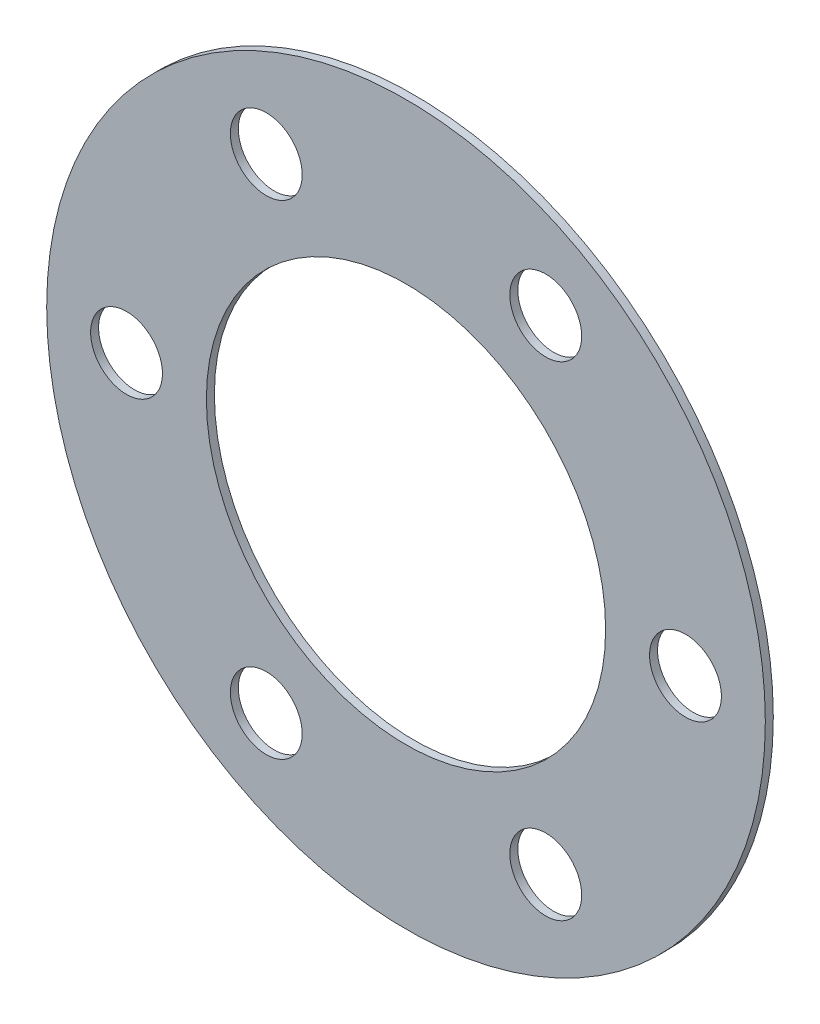
ISO-10303-21;
HEADER;
FILE_DESCRIPTION(('STEP AP214'),'2;1');
FILE_NAME('part.step','',(''),(''),'','','');
FILE_SCHEMA(('AUTOMOTIVE_DESIGN { 1 0 10303 214 1 1 1 1 }'));
ENDSEC;
DATA;
#1=APPLICATION_CONTEXT('core data for automotive mechanical design processes');
#2=APPLICATION_PROTOCOL_DEFINITION('international standard','automotive_design',2000,#1);
#3=PRODUCT_CONTEXT('',#1,'mechanical');
#4=PRODUCT('Part','Part','',(#3));
#5=PRODUCT_RELATED_PRODUCT_CATEGORY('part','',(#4));
#6=PRODUCT_DEFINITION_FORMATION('','',#4);
#7=PRODUCT_DEFINITION_CONTEXT('part definition',#1,'design');
#8=PRODUCT_DEFINITION('design','',#6,#7);
#9=PRODUCT_DEFINITION_SHAPE('','',#8);
#10=(LENGTH_UNIT() NAMED_UNIT(*) SI_UNIT(.MILLI.,.METRE.));
#11=(NAMED_UNIT(*) PLANE_ANGLE_UNIT() SI_UNIT($,.RADIAN.));
#12=(NAMED_UNIT(*) SI_UNIT($,.STERADIAN.) SOLID_ANGLE_UNIT());
#13=UNCERTAINTY_MEASURE_WITH_UNIT(LENGTH_MEASURE(1.E-05),#10,'distance_accuracy_value','');
#14=(GEOMETRIC_REPRESENTATION_CONTEXT(3) GLOBAL_UNCERTAINTY_ASSIGNED_CONTEXT((#13)) GLOBAL_UNIT_ASSIGNED_CONTEXT((#10,
#11,#12)) REPRESENTATION_CONTEXT('',''));
#15=CARTESIAN_POINT('',(0.,0.,0.));
#16=DIRECTION('',(0.,0.,1.));
#17=DIRECTION('',(1.,0.,0.));
#18=AXIS2_PLACEMENT_3D('',#15,#16,#17);
#19=CARTESIAN_POINT('',(0.,0.,1.));
#20=DIRECTION('',(0.,0.,1.));
#21=DIRECTION('',(1.,0.,0.));
#22=AXIS2_PLACEMENT_3D('',#19,#20,#21);
#23=PLANE('',#22);
#24=CARTESIAN_POINT('',(-35.,0.,1.));
#25=DIRECTION('',(0.,0.,1.));
#26=DIRECTION('',(1.,0.,0.));
#27=AXIS2_PLACEMENT_3D('',#24,#25,#26);
#28=CIRCLE('',#27,4.5);
#29=CARTESIAN_POINT('',(-30.5,0.,1.));
#30=VERTEX_POINT('',#29);
#31=EDGE_CURVE('E74',#30,#30,#28,.T.);
#32=ORIENTED_EDGE('',*,*,#31,.F.);
#33=EDGE_LOOP('',(#32));
#34=FACE_BOUND('',#33,.T.);
#35=CARTESIAN_POINT('',(17.4999999999997,-30.3108891324555,1.));
#36=DIRECTION('',(0.,0.,1.));
#37=DIRECTION('',(1.,0.,0.));
#38=AXIS2_PLACEMENT_3D('',#35,#36,#37);
#39=CIRCLE('',#38,4.5);
#40=CARTESIAN_POINT('',(21.9999999999997,-30.3108891324555,1.));
#41=VERTEX_POINT('',#40);
#42=EDGE_CURVE('E62',#41,#41,#39,.T.);
#43=ORIENTED_EDGE('',*,*,#42,.F.);
#44=EDGE_LOOP('',(#43));
#45=FACE_BOUND('',#44,.T.);
#46=CARTESIAN_POINT('',(17.5000000000001,30.3108891324553,1.));
#47=DIRECTION('',(0.,0.,1.));
#48=DIRECTION('',(1.,0.,0.));
#49=AXIS2_PLACEMENT_3D('',#46,#47,#48);
#50=CIRCLE('',#49,4.5);
#51=CARTESIAN_POINT('',(22.0000000000001,30.3108891324553,1.));
#52=VERTEX_POINT('',#51);
#53=EDGE_CURVE('E50',#52,#52,#50,.T.);
#54=ORIENTED_EDGE('',*,*,#53,.F.);
#55=EDGE_LOOP('',(#54));
#56=FACE_BOUND('',#55,.T.);
#57=CARTESIAN_POINT('',(0.,0.,1.));
#58=DIRECTION('',(0.,0.,1.));
#59=DIRECTION('',(1.,0.,0.));
#60=AXIS2_PLACEMENT_3D('',#57,#58,#59);
#61=CIRCLE('',#60,45.);
#62=CARTESIAN_POINT('',(45.,0.,1.));
#63=VERTEX_POINT('',#62);
#64=EDGE_CURVE('E10',#63,#63,#61,.T.);
#65=ORIENTED_EDGE('',*,*,#64,.T.);
#66=EDGE_LOOP('',(#65));
#67=FACE_BOUND('',#66,.T.);
#68=CARTESIAN_POINT('',(0.,0.,1.));
#69=DIRECTION('',(0.,0.,1.));
#70=DIRECTION('',(1.,0.,0.));
#71=AXIS2_PLACEMENT_3D('',#68,#69,#70);
#72=CIRCLE('',#71,25.);
#73=CARTESIAN_POINT('',(25.,0.,1.));
#74=VERTEX_POINT('',#73);
#75=EDGE_CURVE('E45',#74,#74,#72,.T.);
#76=ORIENTED_EDGE('',*,*,#75,.F.);
#77=EDGE_LOOP('',(#76));
#78=FACE_BOUND('',#77,.T.);
#79=CARTESIAN_POINT('',(35.,0.,1.));
#80=DIRECTION('',(0.,0.,1.));
#81=DIRECTION('',(1.,0.,0.));
#82=AXIS2_PLACEMENT_3D('',#79,#80,#81);
#83=CIRCLE('',#82,4.5);
#84=CARTESIAN_POINT('',(39.5,0.,1.));
#85=VERTEX_POINT('',#84);
#86=EDGE_CURVE('E56',#85,#85,#83,.T.);
#87=ORIENTED_EDGE('',*,*,#86,.F.);
#88=EDGE_LOOP('',(#87));
#89=FACE_BOUND('',#88,.T.);
#90=CARTESIAN_POINT('',(-17.5000000000004,-30.3108891324552,1.));
#91=DIRECTION('',(0.,0.,1.));
#92=DIRECTION('',(1.,0.,0.));
#93=AXIS2_PLACEMENT_3D('',#90,#91,#92);
#94=CIRCLE('',#93,4.5);
#95=CARTESIAN_POINT('',(-13.0000000000004,-30.3108891324552,1.));
#96=VERTEX_POINT('',#95);
#97=EDGE_CURVE('E68',#96,#96,#94,.T.);
#98=ORIENTED_EDGE('',*,*,#97,.F.);
#99=EDGE_LOOP('',(#98));
#100=FACE_BOUND('',#99,.T.);
#101=CARTESIAN_POINT('',(-17.4999999999999,30.3108891324554,1.));
#102=DIRECTION('',(0.,0.,1.));
#103=DIRECTION('',(1.,0.,0.));
#104=AXIS2_PLACEMENT_3D('',#101,#102,#103);
#105=CIRCLE('',#104,4.5);
#106=CARTESIAN_POINT('',(-12.9999999999999,30.3108891324554,1.));
#107=VERTEX_POINT('',#106);
#108=EDGE_CURVE('E80',#107,#107,#105,.T.);
#109=ORIENTED_EDGE('',*,*,#108,.F.);
#110=EDGE_LOOP('',(#109));
#111=FACE_BOUND('',#110,.T.);
#112=ADVANCED_FACE('F34',(#34,#45,#56,#67,#78,#89,#100,#111),#23,.T.);
#113=CARTESIAN_POINT('',(0.,0.,0.));
#114=DIRECTION('',(0.,0.,1.));
#115=DIRECTION('',(1.,0.,0.));
#116=AXIS2_PLACEMENT_3D('',#113,#114,#115);
#117=PLANE('',#116);
#118=CARTESIAN_POINT('',(0.,0.,0.));
#119=DIRECTION('',(0.,0.,1.));
#120=DIRECTION('',(1.,0.,0.));
#121=AXIS2_PLACEMENT_3D('',#118,#119,#120);
#122=CIRCLE('',#121,45.);
#123=CARTESIAN_POINT('',(45.,0.,0.));
#124=VERTEX_POINT('',#123);
#125=EDGE_CURVE('E38',#124,#124,#122,.T.);
#126=ORIENTED_EDGE('',*,*,#125,.F.);
#127=EDGE_LOOP('',(#126));
#128=FACE_BOUND('',#127,.T.);
#129=CARTESIAN_POINT('',(0.,0.,0.));
#130=DIRECTION('',(0.,0.,1.));
#131=DIRECTION('',(1.,0.,0.));
#132=AXIS2_PLACEMENT_3D('',#129,#130,#131);
#133=CIRCLE('',#132,25.);
#134=CARTESIAN_POINT('',(25.,0.,0.));
#135=VERTEX_POINT('',#134);
#136=EDGE_CURVE('E47',#135,#135,#133,.T.);
#137=ORIENTED_EDGE('',*,*,#136,.T.);
#138=EDGE_LOOP('',(#137));
#139=FACE_BOUND('',#138,.T.);
#140=CARTESIAN_POINT('',(17.5000000000001,30.3108891324553,0.));
#141=DIRECTION('',(0.,0.,1.));
#142=DIRECTION('',(1.,0.,0.));
#143=AXIS2_PLACEMENT_3D('',#140,#141,#142);
#144=CIRCLE('',#143,4.5);
#145=CARTESIAN_POINT('',(22.0000000000001,30.3108891324553,0.));
#146=VERTEX_POINT('',#145);
#147=EDGE_CURVE('E53',#146,#146,#144,.T.);
#148=ORIENTED_EDGE('',*,*,#147,.T.);
#149=EDGE_LOOP('',(#148));
#150=FACE_BOUND('',#149,.T.);
#151=CARTESIAN_POINT('',(35.,0.,0.));
#152=DIRECTION('',(0.,0.,1.));
#153=DIRECTION('',(1.,0.,0.));
#154=AXIS2_PLACEMENT_3D('',#151,#152,#153);
#155=CIRCLE('',#154,4.5);
#156=CARTESIAN_POINT('',(39.5,0.,0.));
#157=VERTEX_POINT('',#156);
#158=EDGE_CURVE('E59',#157,#157,#155,.T.);
#159=ORIENTED_EDGE('',*,*,#158,.T.);
#160=EDGE_LOOP('',(#159));
#161=FACE_BOUND('',#160,.T.);
#162=CARTESIAN_POINT('',(17.4999999999997,-30.3108891324555,0.));
#163=DIRECTION('',(0.,0.,1.));
#164=DIRECTION('',(1.,0.,0.));
#165=AXIS2_PLACEMENT_3D('',#162,#163,#164);
#166=CIRCLE('',#165,4.5);
#167=CARTESIAN_POINT('',(21.9999999999997,-30.3108891324555,0.));
#168=VERTEX_POINT('',#167);
#169=EDGE_CURVE('E65',#168,#168,#166,.T.);
#170=ORIENTED_EDGE('',*,*,#169,.T.);
#171=EDGE_LOOP('',(#170));
#172=FACE_BOUND('',#171,.T.);
#173=CARTESIAN_POINT('',(-17.5000000000004,-30.3108891324552,0.));
#174=DIRECTION('',(0.,0.,1.));
#175=DIRECTION('',(1.,0.,0.));
#176=AXIS2_PLACEMENT_3D('',#173,#174,#175);
#177=CIRCLE('',#176,4.5);
#178=CARTESIAN_POINT('',(-13.0000000000004,-30.3108891324552,0.));
#179=VERTEX_POINT('',#178);
#180=EDGE_CURVE('E71',#179,#179,#177,.T.);
#181=ORIENTED_EDGE('',*,*,#180,.T.);
#182=EDGE_LOOP('',(#181));
#183=FACE_BOUND('',#182,.T.);
#184=CARTESIAN_POINT('',(-35.,0.,0.));
#185=DIRECTION('',(0.,0.,1.));
#186=DIRECTION('',(1.,0.,0.));
#187=AXIS2_PLACEMENT_3D('',#184,#185,#186);
#188=CIRCLE('',#187,4.5);
#189=CARTESIAN_POINT('',(-30.5,0.,0.));
#190=VERTEX_POINT('',#189);
#191=EDGE_CURVE('E77',#190,#190,#188,.T.);
#192=ORIENTED_EDGE('',*,*,#191,.T.);
#193=EDGE_LOOP('',(#192));
#194=FACE_BOUND('',#193,.T.);
#195=CARTESIAN_POINT('',(-17.4999999999999,30.3108891324554,0.));
#196=DIRECTION('',(0.,0.,1.));
#197=DIRECTION('',(1.,0.,0.));
#198=AXIS2_PLACEMENT_3D('',#195,#196,#197);
#199=CIRCLE('',#198,4.5);
#200=CARTESIAN_POINT('',(-12.9999999999999,30.3108891324554,0.));
#201=VERTEX_POINT('',#200);
#202=EDGE_CURVE('E83',#201,#201,#199,.T.);
#203=ORIENTED_EDGE('',*,*,#202,.T.);
#204=EDGE_LOOP('',(#203));
#205=FACE_BOUND('',#204,.T.);
#206=ADVANCED_FACE('F93',(#128,#139,#150,#161,#172,#183,#194,#205),#117,.F.);
#207=CARTESIAN_POINT('',(0.,0.,1.));
#208=DIRECTION('',(0.,0.,-1.));
#209=DIRECTION('',(-1.,0.,0.));
#210=AXIS2_PLACEMENT_3D('',#207,#208,#209);
#211=CYLINDRICAL_SURFACE('',#210,45.);
#212=ORIENTED_EDGE('',*,*,#64,.F.);
#213=EDGE_LOOP('',(#212));
#214=FACE_BOUND('',#213,.T.);
#215=ORIENTED_EDGE('',*,*,#125,.T.);
#216=EDGE_LOOP('',(#215));
#217=FACE_BOUND('',#216,.T.);
#218=ADVANCED_FACE('F36',(#214,#217),#211,.T.);
#219=CARTESIAN_POINT('',(0.,0.,1.));
#220=DIRECTION('',(0.,0.,-1.));
#221=DIRECTION('',(-1.,0.,0.));
#222=AXIS2_PLACEMENT_3D('',#219,#220,#221);
#223=CYLINDRICAL_SURFACE('',#222,25.);
#224=ORIENTED_EDGE('',*,*,#75,.T.);
#225=EDGE_LOOP('',(#224));
#226=FACE_BOUND('',#225,.T.);
#227=ORIENTED_EDGE('',*,*,#136,.F.);
#228=EDGE_LOOP('',(#227));
#229=FACE_BOUND('',#228,.T.);
#230=ADVANCED_FACE('F103',(#226,#229),#223,.F.);
#231=CARTESIAN_POINT('',(17.5000000000001,30.3108891324553,1.));
#232=DIRECTION('',(0.,0.,-1.));
#233=DIRECTION('',(-1.,0.,0.));
#234=AXIS2_PLACEMENT_3D('',#231,#232,#233);
#235=CYLINDRICAL_SURFACE('',#234,4.5);
#236=ORIENTED_EDGE('',*,*,#53,.T.);
#237=EDGE_LOOP('',(#236));
#238=FACE_BOUND('',#237,.T.);
#239=ORIENTED_EDGE('',*,*,#147,.F.);
#240=EDGE_LOOP('',(#239));
#241=FACE_BOUND('',#240,.T.);
#242=ADVANCED_FACE('F106',(#238,#241),#235,.F.);
#243=CARTESIAN_POINT('',(35.,0.,1.));
#244=DIRECTION('',(0.,0.,-1.));
#245=DIRECTION('',(-1.,0.,0.));
#246=AXIS2_PLACEMENT_3D('',#243,#244,#245);
#247=CYLINDRICAL_SURFACE('',#246,4.5);
#248=ORIENTED_EDGE('',*,*,#86,.T.);
#249=EDGE_LOOP('',(#248));
#250=FACE_BOUND('',#249,.T.);
#251=ORIENTED_EDGE('',*,*,#158,.F.);
#252=EDGE_LOOP('',(#251));
#253=FACE_BOUND('',#252,.T.);
#254=ADVANCED_FACE('F110',(#250,#253),#247,.F.);
#255=CARTESIAN_POINT('',(17.4999999999997,-30.3108891324555,1.));
#256=DIRECTION('',(0.,0.,-1.));
#257=DIRECTION('',(-1.,0.,0.));
#258=AXIS2_PLACEMENT_3D('',#255,#256,#257);
#259=CYLINDRICAL_SURFACE('',#258,4.5);
#260=ORIENTED_EDGE('',*,*,#42,.T.);
#261=EDGE_LOOP('',(#260));
#262=FACE_BOUND('',#261,.T.);
#263=ORIENTED_EDGE('',*,*,#169,.F.);
#264=EDGE_LOOP('',(#263));
#265=FACE_BOUND('',#264,.T.);
#266=ADVANCED_FACE('F114',(#262,#265),#259,.F.);
#267=CARTESIAN_POINT('',(-17.5000000000004,-30.3108891324552,1.));
#268=DIRECTION('',(0.,0.,-1.));
#269=DIRECTION('',(-1.,0.,0.));
#270=AXIS2_PLACEMENT_3D('',#267,#268,#269);
#271=CYLINDRICAL_SURFACE('',#270,4.5);
#272=ORIENTED_EDGE('',*,*,#97,.T.);
#273=EDGE_LOOP('',(#272));
#274=FACE_BOUND('',#273,.T.);
#275=ORIENTED_EDGE('',*,*,#180,.F.);
#276=EDGE_LOOP('',(#275));
#277=FACE_BOUND('',#276,.T.);
#278=ADVANCED_FACE('F118',(#274,#277),#271,.F.);
#279=CARTESIAN_POINT('',(-35.,0.,1.));
#280=DIRECTION('',(0.,0.,-1.));
#281=DIRECTION('',(-1.,0.,0.));
#282=AXIS2_PLACEMENT_3D('',#279,#280,#281);
#283=CYLINDRICAL_SURFACE('',#282,4.5);
#284=ORIENTED_EDGE('',*,*,#31,.T.);
#285=EDGE_LOOP('',(#284));
#286=FACE_BOUND('',#285,.T.);
#287=ORIENTED_EDGE('',*,*,#191,.F.);
#288=EDGE_LOOP('',(#287));
#289=FACE_BOUND('',#288,.T.);
#290=ADVANCED_FACE('F122',(#286,#289),#283,.F.);
#291=CARTESIAN_POINT('',(-17.4999999999999,30.3108891324554,1.));
#292=DIRECTION('',(0.,0.,-1.));
#293=DIRECTION('',(-1.,0.,0.));
#294=AXIS2_PLACEMENT_3D('',#291,#292,#293);
#295=CYLINDRICAL_SURFACE('',#294,4.5);
#296=ORIENTED_EDGE('',*,*,#108,.T.);
#297=EDGE_LOOP('',(#296));
#298=FACE_BOUND('',#297,.T.);
#299=ORIENTED_EDGE('',*,*,#202,.F.);
#300=EDGE_LOOP('',(#299));
#301=FACE_BOUND('',#300,.T.);
#302=ADVANCED_FACE('F89',(#298,#301),#295,.F.);
#303=CLOSED_SHELL('',(#112,#206,#218,#230,#242,#254,#266,#278,#290,#302));
#304=MANIFOLD_SOLID_BREP('B2',#303);
#305=ADVANCED_BREP_SHAPE_REPRESENTATION('',(#18,#304),#14);
#306=SHAPE_DEFINITION_REPRESENTATION(#9,#305);
ENDSEC;
END-ISO-10303-21;
